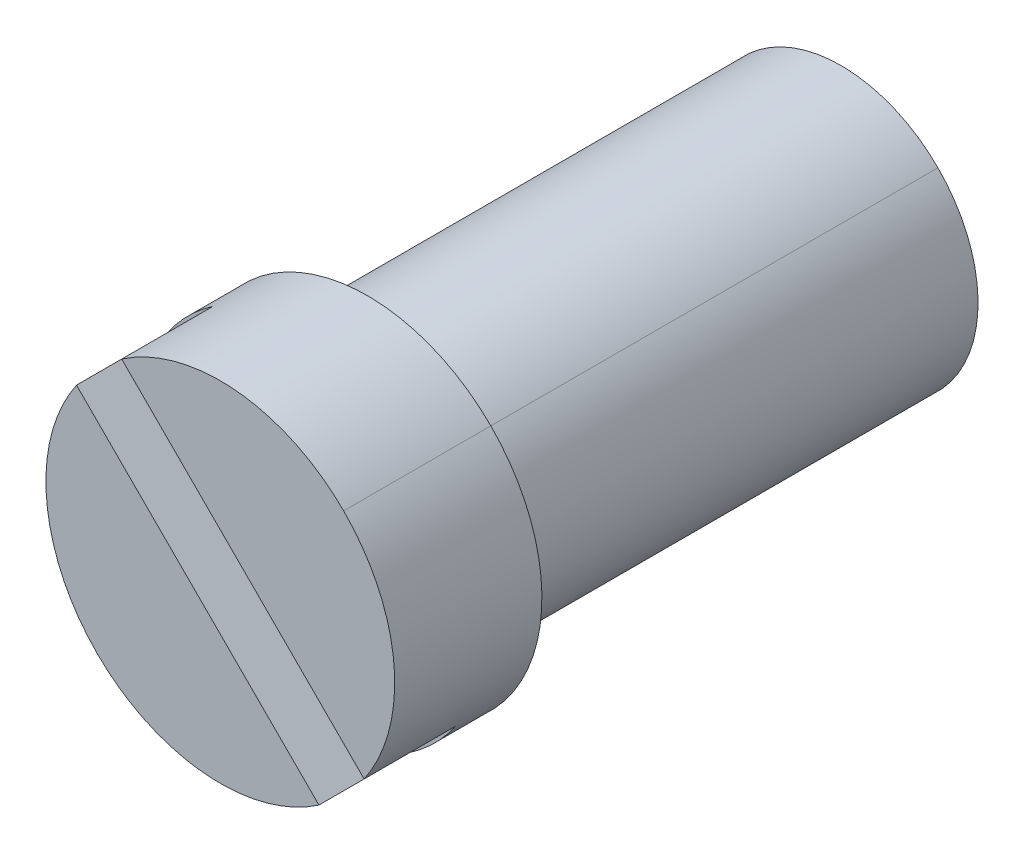
ISO-10303-21;
HEADER;
FILE_DESCRIPTION(('STEP AP214'),'2;1');
FILE_NAME('part.step','',(''),(''),'','','');
FILE_SCHEMA(('AUTOMOTIVE_DESIGN { 1 0 10303 214 1 1 1 1 }'));
ENDSEC;
DATA;
#1=APPLICATION_CONTEXT('core data for automotive mechanical design processes');
#2=APPLICATION_PROTOCOL_DEFINITION('international standard','automotive_design',2000,#1);
#3=PRODUCT_CONTEXT('',#1,'mechanical');
#4=PRODUCT('Part','Part','',(#3));
#5=PRODUCT_RELATED_PRODUCT_CATEGORY('part','',(#4));
#6=PRODUCT_DEFINITION_FORMATION('','',#4);
#7=PRODUCT_DEFINITION_CONTEXT('part definition',#1,'design');
#8=PRODUCT_DEFINITION('design','',#6,#7);
#9=PRODUCT_DEFINITION_SHAPE('','',#8);
#10=(LENGTH_UNIT() NAMED_UNIT(*) SI_UNIT(.MILLI.,.METRE.));
#11=(NAMED_UNIT(*) PLANE_ANGLE_UNIT() SI_UNIT($,.RADIAN.));
#12=(NAMED_UNIT(*) SI_UNIT($,.STERADIAN.) SOLID_ANGLE_UNIT());
#13=UNCERTAINTY_MEASURE_WITH_UNIT(LENGTH_MEASURE(1.E-05),#10,'distance_accuracy_value','');
#14=(GEOMETRIC_REPRESENTATION_CONTEXT(3) GLOBAL_UNCERTAINTY_ASSIGNED_CONTEXT((#13)) GLOBAL_UNIT_ASSIGNED_CONTEXT((#10,
#11,#12)) REPRESENTATION_CONTEXT('',''));
#15=CARTESIAN_POINT('',(0.,0.,0.));
#16=DIRECTION('',(0.,0.,1.));
#17=DIRECTION('',(1.,0.,0.));
#18=AXIS2_PLACEMENT_3D('',#15,#16,#17);
#19=CARTESIAN_POINT('',(7.62034380597097,5.27034380597093,8.76943375672969));
#20=DIRECTION('',(0.,0.,1.));
#21=DIRECTION('',(0.707106781186547,0.707106781186548,0.));
#22=AXIS2_PLACEMENT_3D('',#19,#20,#21);
#23=CYLINDRICAL_SURFACE('',#22,1.5);
#24=DIRECTION('',(0.,0.,-1.));
#25=VECTOR('',#24,1.);
#26=CARTESIAN_POINT('',(8.6810039777508,6.33100397775075,8.76943375672969));
#27=LINE('',#26,#25);
#28=CARTESIAN_POINT('',(8.6810039777508,6.33100397775075,12.0176388374866));
#29=VERTEX_POINT('',#28);
#30=CARTESIAN_POINT('',(8.6810039777508,6.33100397775075,6.83));
#31=VERTEX_POINT('',#30);
#32=EDGE_CURVE('E26',#29,#31,#27,.T.);
#33=ORIENTED_EDGE('',*,*,#32,.F.);
#34=CARTESIAN_POINT('',(7.62034380597097,5.27034380597093,12.0176388374866));
#35=DIRECTION('',(0.,0.,-1.));
#36=DIRECTION('',(0.707106781186547,0.707106781186548,0.));
#37=AXIS2_PLACEMENT_3D('',#34,#35,#36);
#38=CIRCLE('',#37,1.5);
#39=CARTESIAN_POINT('',(6.55968363419116,4.20968363419111,12.0176388374866));
#40=VERTEX_POINT('',#39);
#41=EDGE_CURVE('E98',#29,#40,#38,.T.);
#42=ORIENTED_EDGE('',*,*,#41,.T.);
#43=DIRECTION('',(0.,0.,-1.));
#44=VECTOR('',#43,1.);
#45=CARTESIAN_POINT('',(6.55968363419116,4.20968363419111,8.76943375672969));
#46=LINE('',#45,#44);
#47=CARTESIAN_POINT('',(6.55968363419116,4.20968363419111,6.83));
#48=VERTEX_POINT('',#47);
#49=EDGE_CURVE('E49',#40,#48,#46,.T.);
#50=ORIENTED_EDGE('',*,*,#49,.T.);
#51=CARTESIAN_POINT('',(7.62034380597097,5.27034380597093,6.83));
#52=DIRECTION('',(0.,0.,-1.));
#53=DIRECTION('',(0.707106781186547,0.707106781186548,0.));
#54=AXIS2_PLACEMENT_3D('',#51,#52,#53);
#55=CIRCLE('',#54,1.5);
#56=EDGE_CURVE('E129',#31,#48,#55,.T.);
#57=ORIENTED_EDGE('',*,*,#56,.F.);
#58=EDGE_LOOP('',(#33,#42,#50,#57));
#59=FACE_BOUND('',#58,.T.);
#60=ADVANCED_FACE('F17',(#59),#23,.T.);
#61=CARTESIAN_POINT('',(7.62034380597097,5.27034380597093,12.8238194187433));
#62=DIRECTION('',(0.,0.,-1.));
#63=DIRECTION('',(0.707106781186545,0.70710678118655,0.));
#64=AXIS2_PLACEMENT_3D('',#61,#62,#63);
#65=CYLINDRICAL_SURFACE('',#64,1.91034380597093);
#66=DIRECTION('',(0.,0.,1.));
#67=VECTOR('',#66,1.);
#68=CARTESIAN_POINT('',(6.26952674637124,3.91952674637119,12.8238194187433));
#69=LINE('',#68,#67);
#70=CARTESIAN_POINT('',(6.26952674637124,3.91952674637119,12.0176388374866));
#71=VERTEX_POINT('',#70);
#72=CARTESIAN_POINT('',(6.26952674637124,3.91952674637119,13.63));
#73=VERTEX_POINT('',#72);
#74=EDGE_CURVE('E102',#71,#73,#69,.T.);
#75=ORIENTED_EDGE('',*,*,#74,.T.);
#76=CARTESIAN_POINT('',(7.62034380597097,5.27034380597093,13.63));
#77=DIRECTION('',(0.,0.,1.));
#78=DIRECTION('',(0.707106781186545,0.70710678118655,0.));
#79=AXIS2_PLACEMENT_3D('',#76,#77,#78);
#80=CIRCLE('',#79,1.91034380597093);
#81=CARTESIAN_POINT('',(6.04490435190449,6.35080851320685,13.63));
#82=VERTEX_POINT('',#81);
#83=EDGE_CURVE('E85',#82,#73,#80,.T.);
#84=ORIENTED_EDGE('',*,*,#83,.F.);
#85=DIRECTION('',(0.,0.,1.));
#86=VECTOR('',#85,1.);
#87=CARTESIAN_POINT('',(6.04490435190449,6.35080851320685,12.8238194187433));
#88=LINE('',#87,#86);
#89=CARTESIAN_POINT('',(6.04490435190449,6.35080851320685,12.63));
#90=VERTEX_POINT('',#89);
#91=EDGE_CURVE('E150',#90,#82,#88,.T.);
#92=ORIENTED_EDGE('',*,*,#91,.F.);
#93=CARTESIAN_POINT('',(7.62034380597097,5.27034380597093,12.63));
#94=DIRECTION('',(0.,0.,1.));
#95=DIRECTION('',(0.707106781186545,0.70710678118655,0.));
#96=AXIS2_PLACEMENT_3D('',#93,#94,#95);
#97=CIRCLE('',#96,1.91034380597093);
#98=CARTESIAN_POINT('',(6.53987909873507,6.84578326003743,12.63));
#99=VERTEX_POINT('',#98);
#100=EDGE_CURVE('E132',#99,#90,#97,.T.);
#101=ORIENTED_EDGE('',*,*,#100,.F.);
#102=DIRECTION('',(0.,0.,1.));
#103=VECTOR('',#102,1.);
#104=CARTESIAN_POINT('',(6.53987909873507,6.84578326003743,12.8238194187433));
#105=LINE('',#104,#103);
#106=CARTESIAN_POINT('',(6.53987909873507,6.84578326003743,13.63));
#107=VERTEX_POINT('',#106);
#108=EDGE_CURVE('E166',#99,#107,#105,.T.);
#109=ORIENTED_EDGE('',*,*,#108,.T.);
#110=CARTESIAN_POINT('',(7.62034380597097,5.27034380597093,13.63));
#111=DIRECTION('',(0.,0.,1.));
#112=DIRECTION('',(0.707106781186545,0.70710678118655,0.));
#113=AXIS2_PLACEMENT_3D('',#110,#111,#112);
#114=CIRCLE('',#113,1.91034380597093);
#115=CARTESIAN_POINT('',(8.97116086557072,6.62116086557068,13.63));
#116=VERTEX_POINT('',#115);
#117=EDGE_CURVE('E11',#116,#107,#114,.T.);
#118=ORIENTED_EDGE('',*,*,#117,.F.);
#119=DIRECTION('',(0.,0.,1.));
#120=VECTOR('',#119,1.);
#121=CARTESIAN_POINT('',(8.97116086557072,6.62116086557068,12.8238194187433));
#122=LINE('',#121,#120);
#123=CARTESIAN_POINT('',(8.97116086557072,6.62116086557068,12.0176388374866));
#124=VERTEX_POINT('',#123);
#125=EDGE_CURVE('E141',#124,#116,#122,.T.);
#126=ORIENTED_EDGE('',*,*,#125,.F.);
#127=CARTESIAN_POINT('',(7.62034380597097,5.27034380597093,12.0176388374866));
#128=DIRECTION('',(0.,0.,-1.));
#129=DIRECTION('',(0.70710678118655,-0.707106781186545,0.));
#130=AXIS2_PLACEMENT_3D('',#127,#128,#129);
#131=CIRCLE('',#130,1.91034380597093);
#132=EDGE_CURVE('E106',#71,#124,#131,.T.);
#133=ORIENTED_EDGE('',*,*,#132,.F.);
#134=EDGE_LOOP('',(#75,#84,#92,#101,#109,#118,#126,#133));
#135=FACE_BOUND('',#134,.T.);
#136=ADVANCED_FACE('F103',(#135),#65,.T.);
#137=CARTESIAN_POINT('',(8.7222202938885,4.16846731805341,13.63));
#138=DIRECTION('',(0.,0.,-1.));
#139=DIRECTION('',(0.,-1.,0.));
#140=AXIS2_PLACEMENT_3D('',#137,#138,#139);
#141=PLANE('',#140);
#142=DIRECTION('',(-0.707106781186548,0.707106781186547,0.));
#143=VECTOR('',#142,1.);
#144=CARTESIAN_POINT('',(7.86783117938627,5.51783117938623,13.63));
#145=LINE('',#144,#143);
#146=CARTESIAN_POINT('',(9.1957832600374,4.1898790987351,13.63));
#147=VERTEX_POINT('',#146);
#148=EDGE_CURVE('E125',#147,#107,#145,.T.);
#149=ORIENTED_EDGE('',*,*,#148,.F.);
#150=CARTESIAN_POINT('',(7.62034380597097,5.27034380597093,13.63));
#151=DIRECTION('',(0.,0.,1.));
#152=DIRECTION('',(0.707106781186545,0.70710678118655,0.));
#153=AXIS2_PLACEMENT_3D('',#150,#151,#152);
#154=CIRCLE('',#153,1.91034380597093);
#155=EDGE_CURVE('E122',#147,#116,#154,.T.);
#156=ORIENTED_EDGE('',*,*,#155,.T.);
#157=ORIENTED_EDGE('',*,*,#117,.T.);
#158=EDGE_LOOP('',(#149,#156,#157));
#159=FACE_BOUND('',#158,.T.);
#160=ADVANCED_FACE('F192',(#159),#141,.F.);
#161=CARTESIAN_POINT('',(7.62034380597097,5.27034380597093,8.76943375672969));
#162=DIRECTION('',(0.,0.,1.));
#163=DIRECTION('',(0.707106781186547,0.707106781186548,0.));
#164=AXIS2_PLACEMENT_3D('',#161,#162,#163);
#165=CYLINDRICAL_SURFACE('',#164,1.5);
#166=CARTESIAN_POINT('',(7.62034380597097,5.27034380597093,6.83));
#167=DIRECTION('',(0.,0.,-1.));
#168=DIRECTION('',(0.707106781186547,0.707106781186548,0.));
#169=AXIS2_PLACEMENT_3D('',#166,#167,#168);
#170=CIRCLE('',#169,1.5);
#171=EDGE_CURVE('E97',#48,#31,#170,.T.);
#172=ORIENTED_EDGE('',*,*,#171,.F.);
#173=ORIENTED_EDGE('',*,*,#49,.F.);
#174=CARTESIAN_POINT('',(7.62034380597097,5.27034380597093,12.0176388374866));
#175=DIRECTION('',(0.,0.,-1.));
#176=DIRECTION('',(0.707106781186547,0.707106781186548,0.));
#177=AXIS2_PLACEMENT_3D('',#174,#175,#176);
#178=CIRCLE('',#177,1.5);
#179=EDGE_CURVE('E128',#40,#29,#178,.T.);
#180=ORIENTED_EDGE('',*,*,#179,.T.);
#181=ORIENTED_EDGE('',*,*,#32,.T.);
#182=EDGE_LOOP('',(#172,#173,#180,#181));
#183=FACE_BOUND('',#182,.T.);
#184=ADVANCED_FACE('F216',(#183),#165,.T.);
#185=CARTESIAN_POINT('',(6.25562602122467,7.13003633754783,12.63));
#186=DIRECTION('',(0.,0.,-1.));
#187=DIRECTION('',(0.,-1.,0.));
#188=AXIS2_PLACEMENT_3D('',#185,#186,#187);
#189=PLANE('',#188);
#190=DIRECTION('',(-0.707106781186548,0.707106781186547,0.));
#191=VECTOR('',#190,1.);
#192=CARTESIAN_POINT('',(7.86783117938627,5.51783117938623,12.63));
#193=LINE('',#192,#191);
#194=CARTESIAN_POINT('',(9.1957832600374,4.1898790987351,12.63));
#195=VERTEX_POINT('',#194);
#196=EDGE_CURVE('E160',#195,#99,#193,.T.);
#197=ORIENTED_EDGE('',*,*,#196,.T.);
#198=ORIENTED_EDGE('',*,*,#100,.T.);
#199=DIRECTION('',(0.707106781186548,-0.707106781186547,0.));
#200=VECTOR('',#199,1.);
#201=CARTESIAN_POINT('',(7.37285643255569,5.02285643255565,12.63));
#202=LINE('',#201,#200);
#203=CARTESIAN_POINT('',(8.70080851320682,3.69490435190452,12.63));
#204=VERTEX_POINT('',#203);
#205=EDGE_CURVE('E153',#90,#204,#202,.T.);
#206=ORIENTED_EDGE('',*,*,#205,.T.);
#207=CARTESIAN_POINT('',(7.62034380597097,5.27034380597093,12.63));
#208=DIRECTION('',(0.,0.,1.));
#209=DIRECTION('',(0.707106781186545,0.70710678118655,0.));
#210=AXIS2_PLACEMENT_3D('',#207,#208,#209);
#211=CIRCLE('',#210,1.91034380597093);
#212=EDGE_CURVE('E20',#204,#195,#211,.T.);
#213=ORIENTED_EDGE('',*,*,#212,.T.);
#214=EDGE_LOOP('',(#197,#198,#206,#213));
#215=FACE_BOUND('',#214,.T.);
#216=ADVANCED_FACE('F213',(#215),#189,.F.);
#217=CARTESIAN_POINT('',(7.22259624155355,4.8725962415535,6.83));
#218=DIRECTION('',(0.,0.,1.));
#219=DIRECTION('',(0.,-1.,0.));
#220=AXIS2_PLACEMENT_3D('',#217,#218,#219);
#221=PLANE('',#220);
#222=ORIENTED_EDGE('',*,*,#171,.T.);
#223=ORIENTED_EDGE('',*,*,#56,.T.);
#224=EDGE_LOOP('',(#222,#223));
#225=FACE_BOUND('',#224,.T.);
#226=ADVANCED_FACE('F215',(#225),#221,.F.);
#227=CARTESIAN_POINT('',(8.7222202938885,4.16846731805341,13.63));
#228=DIRECTION('',(0.,0.,-1.));
#229=DIRECTION('',(0.,-1.,0.));
#230=AXIS2_PLACEMENT_3D('',#227,#228,#229);
#231=PLANE('',#230);
#232=CARTESIAN_POINT('',(7.62034380597097,5.27034380597093,13.63));
#233=DIRECTION('',(0.,0.,1.));
#234=DIRECTION('',(0.707106781186545,0.70710678118655,0.));
#235=AXIS2_PLACEMENT_3D('',#232,#233,#234);
#236=CIRCLE('',#235,1.91034380597093);
#237=CARTESIAN_POINT('',(8.70080851320682,3.69490435190452,13.63));
#238=VERTEX_POINT('',#237);
#239=EDGE_CURVE('E89',#73,#238,#236,.T.);
#240=ORIENTED_EDGE('',*,*,#239,.T.);
#241=DIRECTION('',(0.707106781186548,-0.707106781186547,0.));
#242=VECTOR('',#241,1.);
#243=CARTESIAN_POINT('',(7.37285643255569,5.02285643255565,13.63));
#244=LINE('',#243,#242);
#245=EDGE_CURVE('E92',#82,#238,#244,.T.);
#246=ORIENTED_EDGE('',*,*,#245,.F.);
#247=ORIENTED_EDGE('',*,*,#83,.T.);
#248=EDGE_LOOP('',(#240,#246,#247));
#249=FACE_BOUND('',#248,.T.);
#250=ADVANCED_FACE('F87',(#249),#231,.F.);
#251=CARTESIAN_POINT('',(8.78558514939705,4.10510246254486,12.0176388374866));
#252=DIRECTION('',(0.,0.,1.));
#253=DIRECTION('',(0.,-1.,0.));
#254=AXIS2_PLACEMENT_3D('',#251,#252,#253);
#255=PLANE('',#254);
#256=ORIENTED_EDGE('',*,*,#179,.F.);
#257=ORIENTED_EDGE('',*,*,#41,.F.);
#258=EDGE_LOOP('',(#256,#257));
#259=FACE_BOUND('',#258,.T.);
#260=CARTESIAN_POINT('',(7.62034380597097,5.27034380597093,12.0176388374866));
#261=DIRECTION('',(0.,0.,-1.));
#262=DIRECTION('',(0.70710678118655,-0.707106781186545,0.));
#263=AXIS2_PLACEMENT_3D('',#260,#261,#262);
#264=CIRCLE('',#263,1.91034380597093);
#265=EDGE_CURVE('E145',#124,#71,#264,.T.);
#266=ORIENTED_EDGE('',*,*,#265,.T.);
#267=ORIENTED_EDGE('',*,*,#132,.T.);
#268=EDGE_LOOP('',(#266,#267));
#269=FACE_BOUND('',#268,.T.);
#270=ADVANCED_FACE('F236',(#259,#269),#255,.F.);
#271=CARTESIAN_POINT('',(7.62034380597097,5.27034380597093,12.8238194187433));
#272=DIRECTION('',(0.,0.,-1.));
#273=DIRECTION('',(0.707106781186545,0.70710678118655,0.));
#274=AXIS2_PLACEMENT_3D('',#271,#272,#273);
#275=CYLINDRICAL_SURFACE('',#274,1.91034380597093);
#276=ORIENTED_EDGE('',*,*,#265,.F.);
#277=ORIENTED_EDGE('',*,*,#125,.T.);
#278=ORIENTED_EDGE('',*,*,#155,.F.);
#279=DIRECTION('',(0.,0.,1.));
#280=VECTOR('',#279,1.);
#281=CARTESIAN_POINT('',(9.1957832600374,4.1898790987351,12.8238194187433));
#282=LINE('',#281,#280);
#283=EDGE_CURVE('E156',#195,#147,#282,.T.);
#284=ORIENTED_EDGE('',*,*,#283,.F.);
#285=ORIENTED_EDGE('',*,*,#212,.F.);
#286=DIRECTION('',(0.,0.,1.));
#287=VECTOR('',#286,1.);
#288=CARTESIAN_POINT('',(8.70080851320682,3.69490435190452,12.8238194187433));
#289=LINE('',#288,#287);
#290=EDGE_CURVE('E115',#204,#238,#289,.T.);
#291=ORIENTED_EDGE('',*,*,#290,.T.);
#292=ORIENTED_EDGE('',*,*,#239,.F.);
#293=ORIENTED_EDGE('',*,*,#74,.F.);
#294=EDGE_LOOP('',(#276,#277,#278,#284,#285,#291,#292,#293));
#295=FACE_BOUND('',#294,.T.);
#296=ADVANCED_FACE('F112',(#295),#275,.T.);
#297=CARTESIAN_POINT('',(5.76065127439408,6.63506159071725,12.63));
#298=DIRECTION('',(-0.707106781186547,-0.707106781186548,0.));
#299=DIRECTION('',(-0.707106781186548,0.707106781186547,0.));
#300=AXIS2_PLACEMENT_3D('',#297,#298,#299);
#301=PLANE('',#300);
#302=ORIENTED_EDGE('',*,*,#205,.F.);
#303=ORIENTED_EDGE('',*,*,#91,.T.);
#304=ORIENTED_EDGE('',*,*,#245,.T.);
#305=ORIENTED_EDGE('',*,*,#290,.F.);
#306=EDGE_LOOP('',(#302,#303,#304,#305));
#307=FACE_BOUND('',#306,.T.);
#308=ADVANCED_FACE('F212',(#307),#301,.F.);
#309=CARTESIAN_POINT('',(6.25562602122467,7.13003633754783,14.515608753973));
#310=DIRECTION('',(0.707106781186547,0.707106781186548,0.));
#311=DIRECTION('',(0.,0.,-1.));
#312=AXIS2_PLACEMENT_3D('',#309,#310,#311);
#313=PLANE('',#312);
#314=ORIENTED_EDGE('',*,*,#148,.T.);
#315=ORIENTED_EDGE('',*,*,#108,.F.);
#316=ORIENTED_EDGE('',*,*,#196,.F.);
#317=ORIENTED_EDGE('',*,*,#283,.T.);
#318=EDGE_LOOP('',(#314,#315,#316,#317));
#319=FACE_BOUND('',#318,.T.);
#320=ADVANCED_FACE('F188',(#319),#313,.F.);
#321=CLOSED_SHELL('',(#60,#136,#160,#184,#216,#226,#250,#270,#296,#308,#320));
#322=MANIFOLD_SOLID_BREP('B1',#321);
#323=ADVANCED_BREP_SHAPE_REPRESENTATION('',(#18,#322),#14);
#324=SHAPE_DEFINITION_REPRESENTATION(#9,#323);
ENDSEC;
END-ISO-10303-21;
